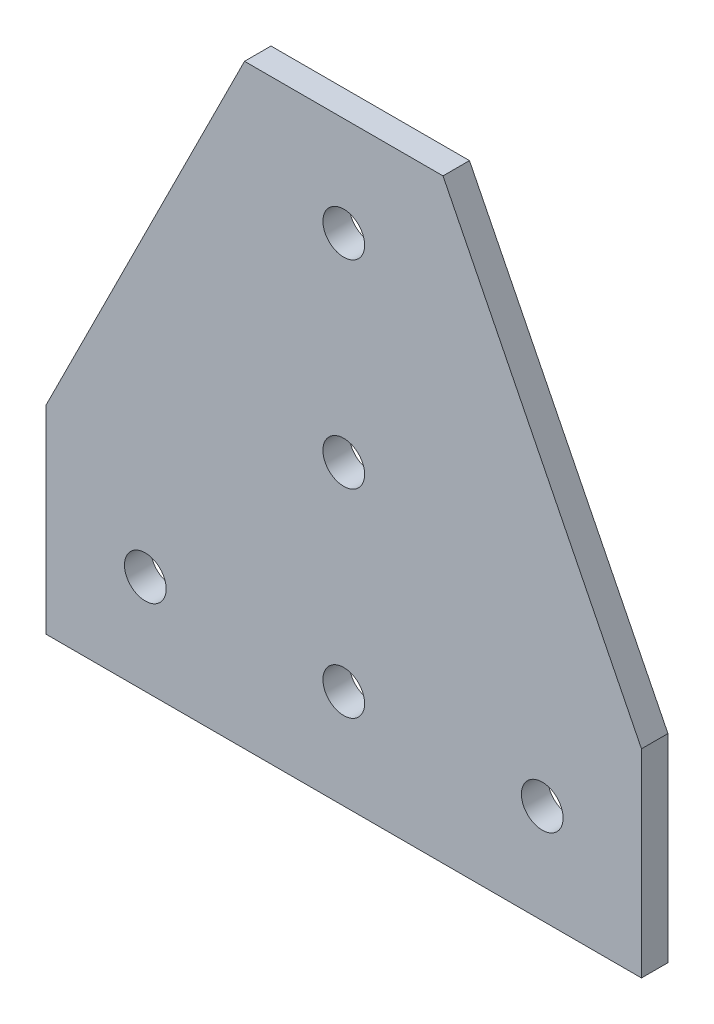
ISO-10303-21;
HEADER;
FILE_DESCRIPTION(('STEP AP214'),'2;1');
FILE_NAME('part.step','',(''),(''),'','','');
FILE_SCHEMA(('AUTOMOTIVE_DESIGN { 1 0 10303 214 1 1 1 1 }'));
ENDSEC;
DATA;
#1=APPLICATION_CONTEXT('core data for automotive mechanical design processes');
#2=APPLICATION_PROTOCOL_DEFINITION('international standard','automotive_design',2000,#1);
#3=PRODUCT_CONTEXT('',#1,'mechanical');
#4=PRODUCT('Part','Part','',(#3));
#5=PRODUCT_RELATED_PRODUCT_CATEGORY('part','',(#4));
#6=PRODUCT_DEFINITION_FORMATION('','',#4);
#7=PRODUCT_DEFINITION_CONTEXT('part definition',#1,'design');
#8=PRODUCT_DEFINITION('design','',#6,#7);
#9=PRODUCT_DEFINITION_SHAPE('','',#8);
#10=(LENGTH_UNIT() NAMED_UNIT(*) SI_UNIT(.MILLI.,.METRE.));
#11=(NAMED_UNIT(*) PLANE_ANGLE_UNIT() SI_UNIT($,.RADIAN.));
#12=(NAMED_UNIT(*) SI_UNIT($,.STERADIAN.) SOLID_ANGLE_UNIT());
#13=UNCERTAINTY_MEASURE_WITH_UNIT(LENGTH_MEASURE(1.E-05),#10,'distance_accuracy_value','');
#14=(GEOMETRIC_REPRESENTATION_CONTEXT(3) GLOBAL_UNCERTAINTY_ASSIGNED_CONTEXT((#13)) GLOBAL_UNIT_ASSIGNED_CONTEXT((#10,
#11,#12)) REPRESENTATION_CONTEXT('',''));
#15=CARTESIAN_POINT('',(0.,0.,0.));
#16=DIRECTION('',(0.,0.,1.));
#17=DIRECTION('',(1.,0.,0.));
#18=AXIS2_PLACEMENT_3D('',#15,#16,#17);
#19=CARTESIAN_POINT('',(-45.984614053,37.315723434,0.));
#20=DIRECTION('',(0.894427190999916,-0.447213595499958,0.));
#21=DIRECTION('',(0.447213595499958,0.894427190999916,0.));
#22=AXIS2_PLACEMENT_3D('',#19,#20,#21);
#23=PLANE('',#22);
#24=DIRECTION('',(0.,0.,1.));
#25=VECTOR('',#24,1.);
#26=CARTESIAN_POINT('',(-45.984614053,37.315723434,2.));
#27=LINE('',#26,#25);
#28=CARTESIAN_POINT('',(-45.984614053,37.315723419,0.));
#29=VERTEX_POINT('',#28);
#30=CARTESIAN_POINT('',(-45.984614053,37.315723434,4.));
#31=VERTEX_POINT('',#30);
#32=EDGE_CURVE('E97',#29,#31,#27,.T.);
#33=ORIENTED_EDGE('',*,*,#32,.T.);
#34=DIRECTION('',(0.447213595499958,0.894427190999916,0.));
#35=VECTOR('',#34,1.);
#36=CARTESIAN_POINT('',(-45.984614053,37.315723434,4.));
#37=LINE('',#36,#35);
#38=CARTESIAN_POINT('',(-15.984614053,97.315723434,4.));
#39=VERTEX_POINT('',#38);
#40=EDGE_CURVE('E106',#31,#39,#37,.T.);
#41=ORIENTED_EDGE('',*,*,#40,.T.);
#42=DIRECTION('',(0.,0.,-1.));
#43=VECTOR('',#42,1.);
#44=CARTESIAN_POINT('',(-15.984614053,97.315723434,2.));
#45=LINE('',#44,#43);
#46=CARTESIAN_POINT('',(-15.984614068,97.315723434,0.));
#47=VERTEX_POINT('',#46);
#48=EDGE_CURVE('E107',#39,#47,#45,.T.);
#49=ORIENTED_EDGE('',*,*,#48,.T.);
#50=DIRECTION('',(0.447213594963302,0.894427191268244,0.));
#51=VECTOR('',#50,1.);
#52=CARTESIAN_POINT('',(-45.984614053,37.315723404,0.));
#53=LINE('',#52,#51);
#54=EDGE_CURVE('E116',#29,#47,#53,.T.);
#55=ORIENTED_EDGE('',*,*,#54,.F.);
#56=EDGE_LOOP('',(#33,#41,#49,#55));
#57=FACE_BOUND('',#56,.T.);
#58=ADVANCED_FACE('F16',(#57),#23,.F.);
#59=CARTESIAN_POINT('',(-15.984614053,97.315723434,0.));
#60=DIRECTION('',(0.,-1.,0.));
#61=DIRECTION('',(1.,0.,0.));
#62=AXIS2_PLACEMENT_3D('',#59,#60,#61);
#63=PLANE('',#62);
#64=ORIENTED_EDGE('',*,*,#48,.F.);
#65=DIRECTION('',(1.,0.,0.));
#66=VECTOR('',#65,1.);
#67=CARTESIAN_POINT('',(-0.984614052999991,97.315723434,4.));
#68=LINE('',#67,#66);
#69=CARTESIAN_POINT('',(14.015385947,97.315723434,4.));
#70=VERTEX_POINT('',#69);
#71=EDGE_CURVE('E93',#39,#70,#68,.T.);
#72=ORIENTED_EDGE('',*,*,#71,.T.);
#73=DIRECTION('',(0.,0.,-1.));
#74=VECTOR('',#73,1.);
#75=CARTESIAN_POINT('',(14.015385947,97.315723434,2.));
#76=LINE('',#75,#74);
#77=CARTESIAN_POINT('',(14.015385962,97.315723434,0.));
#78=VERTEX_POINT('',#77);
#79=EDGE_CURVE('E68',#70,#78,#76,.T.);
#80=ORIENTED_EDGE('',*,*,#79,.T.);
#81=DIRECTION('',(1.,0.,0.));
#82=VECTOR('',#81,1.);
#83=CARTESIAN_POINT('',(-0.984614052999991,97.315723434,0.));
#84=LINE('',#83,#82);
#85=EDGE_CURVE('E113',#47,#78,#84,.T.);
#86=ORIENTED_EDGE('',*,*,#85,.F.);
#87=EDGE_LOOP('',(#64,#72,#80,#86));
#88=FACE_BOUND('',#87,.T.);
#89=ADVANCED_FACE('F193',(#88),#63,.F.);
#90=CARTESIAN_POINT('',(14.015385947,97.315723434,0.));
#91=DIRECTION('',(-0.894427190999916,-0.447213595499958,0.));
#92=DIRECTION('',(0.447213595499958,-0.894427190999916,0.));
#93=AXIS2_PLACEMENT_3D('',#90,#91,#92);
#94=PLANE('',#93);
#95=ORIENTED_EDGE('',*,*,#79,.F.);
#96=DIRECTION('',(0.447213595499958,-0.894427190999916,0.));
#97=VECTOR('',#96,1.);
#98=CARTESIAN_POINT('',(14.015385947,97.315723434,4.));
#99=LINE('',#98,#97);
#100=CARTESIAN_POINT('',(44.015385947,37.315723434,4.));
#101=VERTEX_POINT('',#100);
#102=EDGE_CURVE('E20',#70,#101,#99,.T.);
#103=ORIENTED_EDGE('',*,*,#102,.T.);
#104=DIRECTION('',(0.,0.,-1.));
#105=VECTOR('',#104,1.);
#106=CARTESIAN_POINT('',(44.015385947,37.315723434,2.));
#107=LINE('',#106,#105);
#108=CARTESIAN_POINT('',(44.015385947,37.315723419,0.));
#109=VERTEX_POINT('',#108);
#110=EDGE_CURVE('E75',#101,#109,#107,.T.);
#111=ORIENTED_EDGE('',*,*,#110,.T.);
#112=DIRECTION('',(0.447213594963302,-0.894427191268244,0.));
#113=VECTOR('',#112,1.);
#114=CARTESIAN_POINT('',(14.015385977,97.315723434,0.));
#115=LINE('',#114,#113);
#116=EDGE_CURVE('E115',#78,#109,#115,.T.);
#117=ORIENTED_EDGE('',*,*,#116,.F.);
#118=EDGE_LOOP('',(#95,#103,#111,#117));
#119=FACE_BOUND('',#118,.T.);
#120=ADVANCED_FACE('F92',(#119),#94,.F.);
#121=CARTESIAN_POINT('',(44.015385947,7.315723434,0.));
#122=DIRECTION('',(-1.,0.,0.));
#123=DIRECTION('',(0.,0.,1.));
#124=AXIS2_PLACEMENT_3D('',#121,#122,#123);
#125=PLANE('',#124);
#126=ORIENTED_EDGE('',*,*,#110,.F.);
#127=DIRECTION('',(0.,-1.,0.));
#128=VECTOR('',#127,1.);
#129=CARTESIAN_POINT('',(44.015385947,52.315723434,4.));
#130=LINE('',#129,#128);
#131=CARTESIAN_POINT('',(44.015385947,7.315723434,4.));
#132=VERTEX_POINT('',#131);
#133=EDGE_CURVE('E79',#101,#132,#130,.T.);
#134=ORIENTED_EDGE('',*,*,#133,.T.);
#135=DIRECTION('',(0.,0.,-1.));
#136=VECTOR('',#135,1.);
#137=CARTESIAN_POINT('',(44.015385947,7.315723434,2.));
#138=LINE('',#137,#136);
#139=CARTESIAN_POINT('',(44.015385947,7.315723434,0.));
#140=VERTEX_POINT('',#139);
#141=EDGE_CURVE('E81',#132,#140,#138,.T.);
#142=ORIENTED_EDGE('',*,*,#141,.T.);
#143=DIRECTION('',(0.,-1.,0.));
#144=VECTOR('',#143,1.);
#145=CARTESIAN_POINT('',(44.015385947,52.315723434,0.));
#146=LINE('',#145,#144);
#147=EDGE_CURVE('E80',#109,#140,#146,.T.);
#148=ORIENTED_EDGE('',*,*,#147,.F.);
#149=EDGE_LOOP('',(#126,#134,#142,#148));
#150=FACE_BOUND('',#149,.T.);
#151=ADVANCED_FACE('F77',(#150),#125,.F.);
#152=CARTESIAN_POINT('',(44.015385947,7.315723434,0.));
#153=DIRECTION('',(0.,1.,0.));
#154=DIRECTION('',(-1.,0.,0.));
#155=AXIS2_PLACEMENT_3D('',#152,#153,#154);
#156=PLANE('',#155);
#157=ORIENTED_EDGE('',*,*,#141,.F.);
#158=DIRECTION('',(-1.,0.,0.));
#159=VECTOR('',#158,1.);
#160=CARTESIAN_POINT('',(-0.984614052999991,7.315723434,4.));
#161=LINE('',#160,#159);
#162=CARTESIAN_POINT('',(-45.984614053,7.315723434,4.));
#163=VERTEX_POINT('',#162);
#164=EDGE_CURVE('E90',#132,#163,#161,.T.);
#165=ORIENTED_EDGE('',*,*,#164,.T.);
#166=DIRECTION('',(0.,0.,-1.));
#167=VECTOR('',#166,1.);
#168=CARTESIAN_POINT('',(-45.984614053,7.315723434,2.));
#169=LINE('',#168,#167);
#170=CARTESIAN_POINT('',(-45.984614053,7.315723434,0.));
#171=VERTEX_POINT('',#170);
#172=EDGE_CURVE('E94',#163,#171,#169,.T.);
#173=ORIENTED_EDGE('',*,*,#172,.T.);
#174=DIRECTION('',(-1.,0.,0.));
#175=VECTOR('',#174,1.);
#176=CARTESIAN_POINT('',(-0.984614052999991,7.315723434,0.));
#177=LINE('',#176,#175);
#178=EDGE_CURVE('E35',#140,#171,#177,.T.);
#179=ORIENTED_EDGE('',*,*,#178,.F.);
#180=EDGE_LOOP('',(#157,#165,#173,#179));
#181=FACE_BOUND('',#180,.T.);
#182=ADVANCED_FACE('F153',(#181),#156,.F.);
#183=CARTESIAN_POINT('',(-45.984614053,7.315723434,4.));
#184=DIRECTION('',(1.,0.,0.));
#185=DIRECTION('',(0.,0.,-1.));
#186=AXIS2_PLACEMENT_3D('',#183,#184,#185);
#187=PLANE('',#186);
#188=ORIENTED_EDGE('',*,*,#172,.F.);
#189=DIRECTION('',(0.,1.,0.));
#190=VECTOR('',#189,1.);
#191=CARTESIAN_POINT('',(-45.984614053,52.315723434,4.));
#192=LINE('',#191,#190);
#193=EDGE_CURVE('E103',#163,#31,#192,.T.);
#194=ORIENTED_EDGE('',*,*,#193,.T.);
#195=ORIENTED_EDGE('',*,*,#32,.F.);
#196=DIRECTION('',(0.,1.,0.));
#197=VECTOR('',#196,1.);
#198=CARTESIAN_POINT('',(-45.984614053,52.315723434,0.));
#199=LINE('',#198,#197);
#200=EDGE_CURVE('E110',#171,#29,#199,.T.);
#201=ORIENTED_EDGE('',*,*,#200,.F.);
#202=EDGE_LOOP('',(#188,#194,#195,#201));
#203=FACE_BOUND('',#202,.T.);
#204=ADVANCED_FACE('F150',(#203),#187,.F.);
#205=CARTESIAN_POINT('',(-0.984614053,22.315723434,4.));
#206=DIRECTION('',(0.,0.,-1.));
#207=DIRECTION('',(-1.,0.,0.));
#208=AXIS2_PLACEMENT_3D('',#205,#206,#207);
#209=CYLINDRICAL_SURFACE('',#208,3.15);
#210=CARTESIAN_POINT('',(-0.984614053,22.315723434,4.));
#211=DIRECTION('',(0.,0.,-1.));
#212=DIRECTION('',(-1.,0.,0.));
#213=AXIS2_PLACEMENT_3D('',#210,#211,#212);
#214=CIRCLE('',#213,3.15);
#215=CARTESIAN_POINT('',(-4.134614053,22.315723434,4.));
#216=VERTEX_POINT('',#215);
#217=EDGE_CURVE('E142',#216,#216,#214,.F.);
#218=ORIENTED_EDGE('',*,*,#217,.T.);
#219=EDGE_LOOP('',(#218));
#220=FACE_BOUND('',#219,.T.);
#221=CARTESIAN_POINT('',(-0.984614053,22.315723434,0.));
#222=DIRECTION('',(0.,0.,-1.));
#223=DIRECTION('',(-1.,0.,0.));
#224=AXIS2_PLACEMENT_3D('',#221,#222,#223);
#225=CIRCLE('',#224,3.15);
#226=CARTESIAN_POINT('',(-4.134614053,22.315723434,0.));
#227=VERTEX_POINT('',#226);
#228=EDGE_CURVE('E112',#227,#227,#225,.F.);
#229=ORIENTED_EDGE('',*,*,#228,.F.);
#230=EDGE_LOOP('',(#229));
#231=FACE_BOUND('',#230,.T.);
#232=ADVANCED_FACE('F163',(#220,#231),#209,.F.);
#233=CARTESIAN_POINT('',(-0.984614053,52.315723434,4.));
#234=DIRECTION('',(0.,0.,-1.));
#235=DIRECTION('',(-1.,0.,0.));
#236=AXIS2_PLACEMENT_3D('',#233,#234,#235);
#237=CYLINDRICAL_SURFACE('',#236,3.15);
#238=CARTESIAN_POINT('',(-0.984614053,52.315723434,4.));
#239=DIRECTION('',(0.,0.,-1.));
#240=DIRECTION('',(-1.,0.,0.));
#241=AXIS2_PLACEMENT_3D('',#238,#239,#240);
#242=CIRCLE('',#241,3.15);
#243=CARTESIAN_POINT('',(-4.134614053,52.315723434,4.));
#244=VERTEX_POINT('',#243);
#245=EDGE_CURVE('E139',#244,#244,#242,.F.);
#246=ORIENTED_EDGE('',*,*,#245,.T.);
#247=EDGE_LOOP('',(#246));
#248=FACE_BOUND('',#247,.T.);
#249=CARTESIAN_POINT('',(-0.984614053,52.315723434,0.));
#250=DIRECTION('',(0.,0.,-1.));
#251=DIRECTION('',(-1.,0.,0.));
#252=AXIS2_PLACEMENT_3D('',#249,#250,#251);
#253=CIRCLE('',#252,3.15);
#254=CARTESIAN_POINT('',(-4.134614053,52.315723434,0.));
#255=VERTEX_POINT('',#254);
#256=EDGE_CURVE('E126',#255,#255,#253,.F.);
#257=ORIENTED_EDGE('',*,*,#256,.F.);
#258=EDGE_LOOP('',(#257));
#259=FACE_BOUND('',#258,.T.);
#260=ADVANCED_FACE('F183',(#248,#259),#237,.F.);
#261=CARTESIAN_POINT('',(-0.984614053,82.315723434,4.));
#262=DIRECTION('',(0.,0.,-1.));
#263=DIRECTION('',(-1.,0.,0.));
#264=AXIS2_PLACEMENT_3D('',#261,#262,#263);
#265=CYLINDRICAL_SURFACE('',#264,3.15);
#266=CARTESIAN_POINT('',(-0.984614053,82.315723434,4.));
#267=DIRECTION('',(0.,0.,-1.));
#268=DIRECTION('',(-1.,0.,0.));
#269=AXIS2_PLACEMENT_3D('',#266,#267,#268);
#270=CIRCLE('',#269,3.15);
#271=CARTESIAN_POINT('',(-4.134614053,82.315723434,4.));
#272=VERTEX_POINT('',#271);
#273=EDGE_CURVE('E136',#272,#272,#270,.F.);
#274=ORIENTED_EDGE('',*,*,#273,.T.);
#275=EDGE_LOOP('',(#274));
#276=FACE_BOUND('',#275,.T.);
#277=CARTESIAN_POINT('',(-0.984614053,82.315723434,0.));
#278=DIRECTION('',(0.,0.,-1.));
#279=DIRECTION('',(-1.,0.,0.));
#280=AXIS2_PLACEMENT_3D('',#277,#278,#279);
#281=CIRCLE('',#280,3.15);
#282=CARTESIAN_POINT('',(-4.134614053,82.315723434,0.));
#283=VERTEX_POINT('',#282);
#284=EDGE_CURVE('E123',#283,#283,#281,.F.);
#285=ORIENTED_EDGE('',*,*,#284,.F.);
#286=EDGE_LOOP('',(#285));
#287=FACE_BOUND('',#286,.T.);
#288=ADVANCED_FACE('F179',(#276,#287),#265,.F.);
#289=CARTESIAN_POINT('',(29.015385947,22.315723434,4.));
#290=DIRECTION('',(0.,0.,-1.));
#291=DIRECTION('',(-1.,0.,0.));
#292=AXIS2_PLACEMENT_3D('',#289,#290,#291);
#293=CYLINDRICAL_SURFACE('',#292,3.15);
#294=CARTESIAN_POINT('',(29.015385947,22.315723434,4.));
#295=DIRECTION('',(0.,0.,-1.));
#296=DIRECTION('',(-1.,0.,0.));
#297=AXIS2_PLACEMENT_3D('',#294,#295,#296);
#298=CIRCLE('',#297,3.15);
#299=CARTESIAN_POINT('',(25.865385947,22.315723434,4.));
#300=VERTEX_POINT('',#299);
#301=EDGE_CURVE('E133',#300,#300,#298,.F.);
#302=ORIENTED_EDGE('',*,*,#301,.T.);
#303=EDGE_LOOP('',(#302));
#304=FACE_BOUND('',#303,.T.);
#305=CARTESIAN_POINT('',(29.015385947,22.315723434,0.));
#306=DIRECTION('',(0.,0.,-1.));
#307=DIRECTION('',(-1.,0.,0.));
#308=AXIS2_PLACEMENT_3D('',#305,#306,#307);
#309=CIRCLE('',#308,3.15);
#310=CARTESIAN_POINT('',(25.865385947,22.315723434,0.));
#311=VERTEX_POINT('',#310);
#312=EDGE_CURVE('E120',#311,#311,#309,.F.);
#313=ORIENTED_EDGE('',*,*,#312,.F.);
#314=EDGE_LOOP('',(#313));
#315=FACE_BOUND('',#314,.T.);
#316=ADVANCED_FACE('F176',(#304,#315),#293,.F.);
#317=CARTESIAN_POINT('',(44.015385947,7.315723434,4.));
#318=DIRECTION('',(0.,0.,-1.));
#319=DIRECTION('',(-1.,0.,0.));
#320=AXIS2_PLACEMENT_3D('',#317,#318,#319);
#321=PLANE('',#320);
#322=CARTESIAN_POINT('',(-30.984614053,22.315723434,4.));
#323=DIRECTION('',(0.,0.,-1.));
#324=DIRECTION('',(-1.,0.,0.));
#325=AXIS2_PLACEMENT_3D('',#322,#323,#324);
#326=CIRCLE('',#325,3.15);
#327=CARTESIAN_POINT('',(-34.134614053,22.315723434,4.));
#328=VERTEX_POINT('',#327);
#329=EDGE_CURVE('E26',#328,#328,#326,.F.);
#330=ORIENTED_EDGE('',*,*,#329,.F.);
#331=EDGE_LOOP('',(#330));
#332=FACE_BOUND('',#331,.T.);
#333=ORIENTED_EDGE('',*,*,#301,.F.);
#334=EDGE_LOOP('',(#333));
#335=FACE_BOUND('',#334,.T.);
#336=ORIENTED_EDGE('',*,*,#273,.F.);
#337=EDGE_LOOP('',(#336));
#338=FACE_BOUND('',#337,.T.);
#339=ORIENTED_EDGE('',*,*,#245,.F.);
#340=EDGE_LOOP('',(#339));
#341=FACE_BOUND('',#340,.T.);
#342=ORIENTED_EDGE('',*,*,#217,.F.);
#343=EDGE_LOOP('',(#342));
#344=FACE_BOUND('',#343,.T.);
#345=ORIENTED_EDGE('',*,*,#193,.F.);
#346=ORIENTED_EDGE('',*,*,#164,.F.);
#347=ORIENTED_EDGE('',*,*,#133,.F.);
#348=ORIENTED_EDGE('',*,*,#102,.F.);
#349=ORIENTED_EDGE('',*,*,#71,.F.);
#350=ORIENTED_EDGE('',*,*,#40,.F.);
#351=EDGE_LOOP('',(#345,#346,#347,#348,#349,#350));
#352=FACE_BOUND('',#351,.T.);
#353=ADVANCED_FACE('F86',(#332,#335,#338,#341,#344,#352),#321,.F.);
#354=CARTESIAN_POINT('',(44.015385947,7.315723434,0.));
#355=DIRECTION('',(0.,0.,-1.));
#356=DIRECTION('',(-1.,0.,0.));
#357=AXIS2_PLACEMENT_3D('',#354,#355,#356);
#358=PLANE('',#357);
#359=CARTESIAN_POINT('',(-30.984614053,22.315723434,0.));
#360=DIRECTION('',(0.,0.,-1.));
#361=DIRECTION('',(-1.,0.,0.));
#362=AXIS2_PLACEMENT_3D('',#359,#360,#361);
#363=CIRCLE('',#362,3.15);
#364=CARTESIAN_POINT('',(-34.134614053,22.315723434,0.));
#365=VERTEX_POINT('',#364);
#366=EDGE_CURVE('E11',#365,#365,#363,.T.);
#367=ORIENTED_EDGE('',*,*,#366,.F.);
#368=EDGE_LOOP('',(#367));
#369=FACE_BOUND('',#368,.T.);
#370=ORIENTED_EDGE('',*,*,#312,.T.);
#371=EDGE_LOOP('',(#370));
#372=FACE_BOUND('',#371,.T.);
#373=ORIENTED_EDGE('',*,*,#284,.T.);
#374=EDGE_LOOP('',(#373));
#375=FACE_BOUND('',#374,.T.);
#376=ORIENTED_EDGE('',*,*,#256,.T.);
#377=EDGE_LOOP('',(#376));
#378=FACE_BOUND('',#377,.T.);
#379=ORIENTED_EDGE('',*,*,#228,.T.);
#380=EDGE_LOOP('',(#379));
#381=FACE_BOUND('',#380,.T.);
#382=ORIENTED_EDGE('',*,*,#178,.T.);
#383=ORIENTED_EDGE('',*,*,#200,.T.);
#384=ORIENTED_EDGE('',*,*,#54,.T.);
#385=ORIENTED_EDGE('',*,*,#85,.T.);
#386=ORIENTED_EDGE('',*,*,#116,.T.);
#387=ORIENTED_EDGE('',*,*,#147,.T.);
#388=EDGE_LOOP('',(#382,#383,#384,#385,#386,#387));
#389=FACE_BOUND('',#388,.T.);
#390=ADVANCED_FACE('F18',(#369,#372,#375,#378,#381,#389),#358,.T.);
#391=CARTESIAN_POINT('',(-30.984614053,22.315723434,4.));
#392=DIRECTION('',(0.,0.,-1.));
#393=DIRECTION('',(-1.,0.,0.));
#394=AXIS2_PLACEMENT_3D('',#391,#392,#393);
#395=CYLINDRICAL_SURFACE('',#394,3.15);
#396=ORIENTED_EDGE('',*,*,#366,.T.);
#397=EDGE_LOOP('',(#396));
#398=FACE_BOUND('',#397,.T.);
#399=ORIENTED_EDGE('',*,*,#329,.T.);
#400=EDGE_LOOP('',(#399));
#401=FACE_BOUND('',#400,.T.);
#402=ADVANCED_FACE('F166',(#398,#401),#395,.F.);
#403=CLOSED_SHELL('',(#58,#89,#120,#151,#182,#204,#232,#260,#288,#316,#353,#390,#402));
#404=MANIFOLD_SOLID_BREP('B1',#403);
#405=ADVANCED_BREP_SHAPE_REPRESENTATION('',(#18,#404),#14);
#406=SHAPE_DEFINITION_REPRESENTATION(#9,#405);
ENDSEC;
END-ISO-10303-21;
